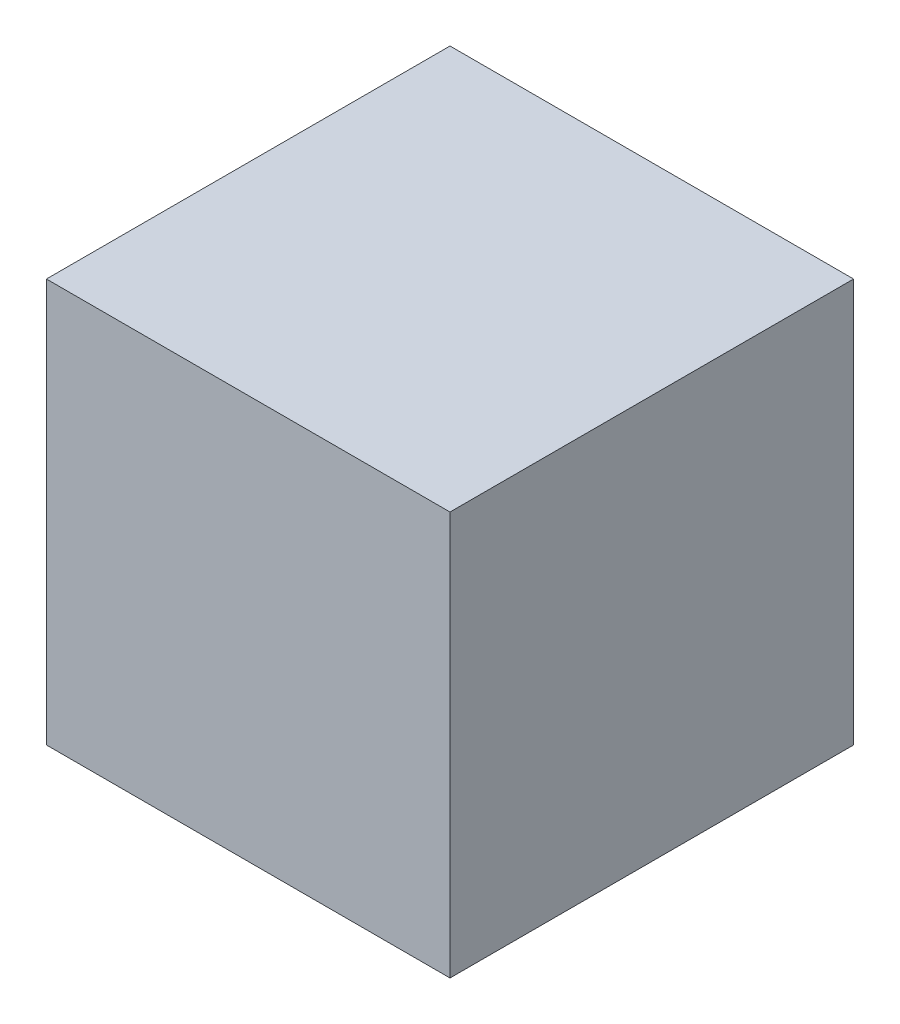
ISO-10303-21;
HEADER;
FILE_DESCRIPTION(('STEP AP214'),'2;1');
FILE_NAME('part.step','',(''),(''),'','','');
FILE_SCHEMA(('AUTOMOTIVE_DESIGN { 1 0 10303 214 1 1 1 1 }'));
ENDSEC;
DATA;
#1=APPLICATION_CONTEXT('core data for automotive mechanical design processes');
#2=APPLICATION_PROTOCOL_DEFINITION('international standard','automotive_design',2000,#1);
#3=PRODUCT_CONTEXT('',#1,'mechanical');
#4=PRODUCT('Part','Part','',(#3));
#5=PRODUCT_RELATED_PRODUCT_CATEGORY('part','',(#4));
#6=PRODUCT_DEFINITION_FORMATION('','',#4);
#7=PRODUCT_DEFINITION_CONTEXT('part definition',#1,'design');
#8=PRODUCT_DEFINITION('design','',#6,#7);
#9=PRODUCT_DEFINITION_SHAPE('','',#8);
#10=(LENGTH_UNIT() NAMED_UNIT(*) SI_UNIT(.MILLI.,.METRE.));
#11=(NAMED_UNIT(*) PLANE_ANGLE_UNIT() SI_UNIT($,.RADIAN.));
#12=(NAMED_UNIT(*) SI_UNIT($,.STERADIAN.) SOLID_ANGLE_UNIT());
#13=UNCERTAINTY_MEASURE_WITH_UNIT(LENGTH_MEASURE(1.E-05),#10,'distance_accuracy_value','');
#14=(GEOMETRIC_REPRESENTATION_CONTEXT(3) GLOBAL_UNCERTAINTY_ASSIGNED_CONTEXT((#13)) GLOBAL_UNIT_ASSIGNED_CONTEXT((#10,
#11,#12)) REPRESENTATION_CONTEXT('',''));
#15=CARTESIAN_POINT('',(0.,0.,0.));
#16=DIRECTION('',(0.,0.,1.));
#17=DIRECTION('',(1.,0.,0.));
#18=AXIS2_PLACEMENT_3D('',#15,#16,#17);
#19=CARTESIAN_POINT('',(0.,990.,0.));
#20=DIRECTION('',(1.,0.,0.));
#21=DIRECTION('',(0.,0.,-1.));
#22=AXIS2_PLACEMENT_3D('',#19,#20,#21);
#23=PLANE('',#22);
#24=DIRECTION('',(0.,0.,1.));
#25=VECTOR('',#24,1.);
#26=CARTESIAN_POINT('',(0.,0.,0.));
#27=LINE('',#26,#25);
#28=CARTESIAN_POINT('',(0.,0.,-1000.));
#29=VERTEX_POINT('',#28);
#30=CARTESIAN_POINT('',(0.,0.,0.));
#31=VERTEX_POINT('',#30);
#32=EDGE_CURVE('E108',#29,#31,#27,.T.);
#33=ORIENTED_EDGE('',*,*,#32,.T.);
#34=DIRECTION('',(0.,-1.,0.));
#35=VECTOR('',#34,1.);
#36=CARTESIAN_POINT('',(0.,990.,0.));
#37=LINE('',#36,#35);
#38=CARTESIAN_POINT('',(0.,1000.,0.));
#39=VERTEX_POINT('',#38);
#40=EDGE_CURVE('E11',#39,#31,#37,.T.);
#41=ORIENTED_EDGE('',*,*,#40,.F.);
#42=DIRECTION('',(0.,0.,1.));
#43=VECTOR('',#42,1.);
#44=CARTESIAN_POINT('',(0.,1000.,-1000.));
#45=LINE('',#44,#43);
#46=CARTESIAN_POINT('',(0.,1000.,-1000.));
#47=VERTEX_POINT('',#46);
#48=EDGE_CURVE('E106',#47,#39,#45,.T.);
#49=ORIENTED_EDGE('',*,*,#48,.F.);
#50=DIRECTION('',(0.,-1.,0.));
#51=VECTOR('',#50,1.);
#52=CARTESIAN_POINT('',(0.,990.,-1000.));
#53=LINE('',#52,#51);
#54=EDGE_CURVE('E164',#47,#29,#53,.T.);
#55=ORIENTED_EDGE('',*,*,#54,.T.);
#56=EDGE_LOOP('',(#33,#41,#49,#55));
#57=FACE_BOUND('',#56,.T.);
#58=ADVANCED_FACE('F38',(#57),#23,.F.);
#59=CARTESIAN_POINT('',(0.,990.,0.));
#60=DIRECTION('',(0.,0.,-1.));
#61=DIRECTION('',(-1.,0.,0.));
#62=AXIS2_PLACEMENT_3D('',#59,#60,#61);
#63=PLANE('',#62);
#64=DIRECTION('',(1.,0.,0.));
#65=VECTOR('',#64,1.);
#66=CARTESIAN_POINT('',(0.,0.,0.));
#67=LINE('',#66,#65);
#68=CARTESIAN_POINT('',(1000.,0.,0.));
#69=VERTEX_POINT('',#68);
#70=EDGE_CURVE('E160',#31,#69,#67,.T.);
#71=ORIENTED_EDGE('',*,*,#70,.T.);
#72=DIRECTION('',(0.,-1.,0.));
#73=VECTOR('',#72,1.);
#74=CARTESIAN_POINT('',(1000.,990.,0.));
#75=LINE('',#74,#73);
#76=CARTESIAN_POINT('',(1000.,1000.,0.));
#77=VERTEX_POINT('',#76);
#78=EDGE_CURVE('E46',#77,#69,#75,.T.);
#79=ORIENTED_EDGE('',*,*,#78,.F.);
#80=DIRECTION('',(1.,0.,0.));
#81=VECTOR('',#80,1.);
#82=CARTESIAN_POINT('',(0.,1000.,0.));
#83=LINE('',#82,#81);
#84=EDGE_CURVE('E111',#39,#77,#83,.T.);
#85=ORIENTED_EDGE('',*,*,#84,.F.);
#86=ORIENTED_EDGE('',*,*,#40,.T.);
#87=EDGE_LOOP('',(#71,#79,#85,#86));
#88=FACE_BOUND('',#87,.T.);
#89=ADVANCED_FACE('F112',(#88),#63,.F.);
#90=CARTESIAN_POINT('',(1000.,990.,0.));
#91=DIRECTION('',(-1.,0.,0.));
#92=DIRECTION('',(0.,0.,1.));
#93=AXIS2_PLACEMENT_3D('',#90,#91,#92);
#94=PLANE('',#93);
#95=DIRECTION('',(0.,0.,-1.));
#96=VECTOR('',#95,1.);
#97=CARTESIAN_POINT('',(1000.,0.,0.));
#98=LINE('',#97,#96);
#99=CARTESIAN_POINT('',(1000.,0.,-1000.));
#100=VERTEX_POINT('',#99);
#101=EDGE_CURVE('E61',#69,#100,#98,.T.);
#102=ORIENTED_EDGE('',*,*,#101,.T.);
#103=DIRECTION('',(0.,-1.,0.));
#104=VECTOR('',#103,1.);
#105=CARTESIAN_POINT('',(1000.,990.,-1000.));
#106=LINE('',#105,#104);
#107=CARTESIAN_POINT('',(1000.,1000.,-1000.));
#108=VERTEX_POINT('',#107);
#109=EDGE_CURVE('E166',#108,#100,#106,.T.);
#110=ORIENTED_EDGE('',*,*,#109,.F.);
#111=DIRECTION('',(0.,0.,-1.));
#112=VECTOR('',#111,1.);
#113=CARTESIAN_POINT('',(1000.,1000.,-1000.));
#114=LINE('',#113,#112);
#115=EDGE_CURVE('E116',#77,#108,#114,.T.);
#116=ORIENTED_EDGE('',*,*,#115,.F.);
#117=ORIENTED_EDGE('',*,*,#78,.T.);
#118=EDGE_LOOP('',(#102,#110,#116,#117));
#119=FACE_BOUND('',#118,.T.);
#120=ADVANCED_FACE('F167',(#119),#94,.F.);
#121=CARTESIAN_POINT('',(0.,990.,-1000.));
#122=DIRECTION('',(0.,0.,1.));
#123=DIRECTION('',(1.,0.,0.));
#124=AXIS2_PLACEMENT_3D('',#121,#122,#123);
#125=PLANE('',#124);
#126=DIRECTION('',(-1.,0.,0.));
#127=VECTOR('',#126,1.);
#128=CARTESIAN_POINT('',(0.,0.,-1000.));
#129=LINE('',#128,#127);
#130=EDGE_CURVE('E53',#100,#29,#129,.T.);
#131=ORIENTED_EDGE('',*,*,#130,.T.);
#132=ORIENTED_EDGE('',*,*,#54,.F.);
#133=DIRECTION('',(-1.,0.,0.));
#134=VECTOR('',#133,1.);
#135=CARTESIAN_POINT('',(0.,1000.,-1000.));
#136=LINE('',#135,#134);
#137=EDGE_CURVE('E121',#108,#47,#136,.T.);
#138=ORIENTED_EDGE('',*,*,#137,.F.);
#139=ORIENTED_EDGE('',*,*,#109,.T.);
#140=EDGE_LOOP('',(#131,#132,#138,#139));
#141=FACE_BOUND('',#140,.T.);
#142=ADVANCED_FACE('F171',(#141),#125,.F.);
#143=CARTESIAN_POINT('',(0.,0.,0.));
#144=DIRECTION('',(0.,-1.,0.));
#145=DIRECTION('',(0.,0.,-1.));
#146=AXIS2_PLACEMENT_3D('',#143,#144,#145);
#147=PLANE('',#146);
#148=ORIENTED_EDGE('',*,*,#32,.F.);
#149=ORIENTED_EDGE('',*,*,#130,.F.);
#150=ORIENTED_EDGE('',*,*,#101,.F.);
#151=ORIENTED_EDGE('',*,*,#70,.F.);
#152=EDGE_LOOP('',(#148,#149,#150,#151));
#153=FACE_BOUND('',#152,.T.);
#154=ADVANCED_FACE('F169',(#153),#147,.T.);
#155=CARTESIAN_POINT('',(0.,1000.,0.));
#156=DIRECTION('',(0.,1.,0.));
#157=DIRECTION('',(0.,0.,1.));
#158=AXIS2_PLACEMENT_3D('',#155,#156,#157);
#159=PLANE('',#158);
#160=ORIENTED_EDGE('',*,*,#48,.T.);
#161=ORIENTED_EDGE('',*,*,#84,.T.);
#162=ORIENTED_EDGE('',*,*,#115,.T.);
#163=ORIENTED_EDGE('',*,*,#137,.T.);
#164=EDGE_LOOP('',(#160,#161,#162,#163));
#165=FACE_BOUND('',#164,.T.);
#166=ADVANCED_FACE('F119',(#165),#159,.T.);
#167=CLOSED_SHELL('',(#58,#89,#120,#142,#154,#166));
#168=CARTESIAN_POINT('',(0.,10.,0.));
#169=DIRECTION('',(0.,-1.,0.));
#170=DIRECTION('',(0.,0.,-1.));
#171=AXIS2_PLACEMENT_3D('',#168,#169,#170);
#172=PLANE('',#171);
#173=DIRECTION('',(0.,0.,1.));
#174=VECTOR('',#173,1.);
#175=CARTESIAN_POINT('',(10.,10.,0.));
#176=LINE('',#175,#174);
#177=CARTESIAN_POINT('',(10.,10.,-990.));
#178=VERTEX_POINT('',#177);
#179=CARTESIAN_POINT('',(10.,10.,-10.));
#180=VERTEX_POINT('',#179);
#181=EDGE_CURVE('E126',#178,#180,#176,.T.);
#182=ORIENTED_EDGE('',*,*,#181,.T.);
#183=DIRECTION('',(1.,0.,0.));
#184=VECTOR('',#183,1.);
#185=CARTESIAN_POINT('',(0.,10.,-10.));
#186=LINE('',#185,#184);
#187=CARTESIAN_POINT('',(990.,10.,-10.));
#188=VERTEX_POINT('',#187);
#189=EDGE_CURVE('E129',#180,#188,#186,.T.);
#190=ORIENTED_EDGE('',*,*,#189,.T.);
#191=DIRECTION('',(0.,0.,-1.));
#192=VECTOR('',#191,1.);
#193=CARTESIAN_POINT('',(990.,10.,0.));
#194=LINE('',#193,#192);
#195=CARTESIAN_POINT('',(990.,10.,-990.));
#196=VERTEX_POINT('',#195);
#197=EDGE_CURVE('E140',#188,#196,#194,.T.);
#198=ORIENTED_EDGE('',*,*,#197,.T.);
#199=DIRECTION('',(-1.,0.,0.));
#200=VECTOR('',#199,1.);
#201=CARTESIAN_POINT('',(0.,10.,-990.));
#202=LINE('',#201,#200);
#203=EDGE_CURVE('E144',#196,#178,#202,.T.);
#204=ORIENTED_EDGE('',*,*,#203,.T.);
#205=EDGE_LOOP('',(#182,#190,#198,#204));
#206=FACE_BOUND('',#205,.T.);
#207=ADVANCED_FACE('F215',(#206),#172,.F.);
#208=CARTESIAN_POINT('',(0.,990.,-10.));
#209=DIRECTION('',(0.,0.,-1.));
#210=DIRECTION('',(-1.,0.,0.));
#211=AXIS2_PLACEMENT_3D('',#208,#209,#210);
#212=PLANE('',#211);
#213=ORIENTED_EDGE('',*,*,#189,.F.);
#214=DIRECTION('',(0.,-1.,0.));
#215=VECTOR('',#214,1.);
#216=CARTESIAN_POINT('',(10.,990.,-10.));
#217=LINE('',#216,#215);
#218=CARTESIAN_POINT('',(10.,990.,-10.));
#219=VERTEX_POINT('',#218);
#220=EDGE_CURVE('E130',#219,#180,#217,.T.);
#221=ORIENTED_EDGE('',*,*,#220,.F.);
#222=DIRECTION('',(1.,0.,0.));
#223=VECTOR('',#222,1.);
#224=CARTESIAN_POINT('',(0.,990.,-10.));
#225=LINE('',#224,#223);
#226=CARTESIAN_POINT('',(990.,990.,-10.));
#227=VERTEX_POINT('',#226);
#228=EDGE_CURVE('E151',#219,#227,#225,.T.);
#229=ORIENTED_EDGE('',*,*,#228,.T.);
#230=DIRECTION('',(0.,-1.,0.));
#231=VECTOR('',#230,1.);
#232=CARTESIAN_POINT('',(990.,990.,-10.));
#233=LINE('',#232,#231);
#234=EDGE_CURVE('E133',#227,#188,#233,.T.);
#235=ORIENTED_EDGE('',*,*,#234,.T.);
#236=EDGE_LOOP('',(#213,#221,#229,#235));
#237=FACE_BOUND('',#236,.T.);
#238=ADVANCED_FACE('F209',(#237),#212,.T.);
#239=CARTESIAN_POINT('',(990.,990.,0.));
#240=DIRECTION('',(-1.,0.,0.));
#241=DIRECTION('',(0.,0.,1.));
#242=AXIS2_PLACEMENT_3D('',#239,#240,#241);
#243=PLANE('',#242);
#244=ORIENTED_EDGE('',*,*,#197,.F.);
#245=ORIENTED_EDGE('',*,*,#234,.F.);
#246=DIRECTION('',(0.,0.,-1.));
#247=VECTOR('',#246,1.);
#248=CARTESIAN_POINT('',(990.,990.,0.));
#249=LINE('',#248,#247);
#250=CARTESIAN_POINT('',(990.,990.,-990.));
#251=VERTEX_POINT('',#250);
#252=EDGE_CURVE('E154',#227,#251,#249,.T.);
#253=ORIENTED_EDGE('',*,*,#252,.T.);
#254=DIRECTION('',(0.,-1.,0.));
#255=VECTOR('',#254,1.);
#256=CARTESIAN_POINT('',(990.,990.,-990.));
#257=LINE('',#256,#255);
#258=EDGE_CURVE('E137',#251,#196,#257,.T.);
#259=ORIENTED_EDGE('',*,*,#258,.T.);
#260=EDGE_LOOP('',(#244,#245,#253,#259));
#261=FACE_BOUND('',#260,.T.);
#262=ADVANCED_FACE('F214',(#261),#243,.T.);
#263=CARTESIAN_POINT('',(0.,990.,-990.));
#264=DIRECTION('',(0.,0.,1.));
#265=DIRECTION('',(1.,0.,0.));
#266=AXIS2_PLACEMENT_3D('',#263,#264,#265);
#267=PLANE('',#266);
#268=ORIENTED_EDGE('',*,*,#203,.F.);
#269=ORIENTED_EDGE('',*,*,#258,.F.);
#270=DIRECTION('',(-1.,0.,0.));
#271=VECTOR('',#270,1.);
#272=CARTESIAN_POINT('',(0.,990.,-990.));
#273=LINE('',#272,#271);
#274=CARTESIAN_POINT('',(10.,990.,-990.));
#275=VERTEX_POINT('',#274);
#276=EDGE_CURVE('E138',#251,#275,#273,.T.);
#277=ORIENTED_EDGE('',*,*,#276,.T.);
#278=DIRECTION('',(0.,-1.,0.));
#279=VECTOR('',#278,1.);
#280=CARTESIAN_POINT('',(10.,990.,-990.));
#281=LINE('',#280,#279);
#282=EDGE_CURVE('E134',#275,#178,#281,.T.);
#283=ORIENTED_EDGE('',*,*,#282,.T.);
#284=EDGE_LOOP('',(#268,#269,#277,#283));
#285=FACE_BOUND('',#284,.T.);
#286=ADVANCED_FACE('F228',(#285),#267,.T.);
#287=CARTESIAN_POINT('',(10.,990.,0.));
#288=DIRECTION('',(1.,0.,0.));
#289=DIRECTION('',(0.,0.,-1.));
#290=AXIS2_PLACEMENT_3D('',#287,#288,#289);
#291=PLANE('',#290);
#292=ORIENTED_EDGE('',*,*,#181,.F.);
#293=ORIENTED_EDGE('',*,*,#282,.F.);
#294=DIRECTION('',(0.,0.,1.));
#295=VECTOR('',#294,1.);
#296=CARTESIAN_POINT('',(10.,990.,0.));
#297=LINE('',#296,#295);
#298=EDGE_CURVE('E148',#275,#219,#297,.T.);
#299=ORIENTED_EDGE('',*,*,#298,.T.);
#300=ORIENTED_EDGE('',*,*,#220,.T.);
#301=EDGE_LOOP('',(#292,#293,#299,#300));
#302=FACE_BOUND('',#301,.T.);
#303=ADVANCED_FACE('F239',(#302),#291,.T.);
#304=CARTESIAN_POINT('',(0.,990.,0.));
#305=DIRECTION('',(0.,1.,0.));
#306=DIRECTION('',(0.,0.,1.));
#307=AXIS2_PLACEMENT_3D('',#304,#305,#306);
#308=PLANE('',#307);
#309=ORIENTED_EDGE('',*,*,#298,.F.);
#310=ORIENTED_EDGE('',*,*,#276,.F.);
#311=ORIENTED_EDGE('',*,*,#252,.F.);
#312=ORIENTED_EDGE('',*,*,#228,.F.);
#313=EDGE_LOOP('',(#309,#310,#311,#312));
#314=FACE_BOUND('',#313,.T.);
#315=ADVANCED_FACE('F250',(#314),#308,.F.);
#316=CLOSED_SHELL('',(#207,#238,#262,#286,#303,#315));
#317=ORIENTED_CLOSED_SHELL('',*,#316,.T.);
#318=BREP_WITH_VOIDS('B2',#167,(#317));
#319=ADVANCED_BREP_SHAPE_REPRESENTATION('',(#18,#318),#14);
#320=SHAPE_DEFINITION_REPRESENTATION(#9,#319);
ENDSEC;
END-ISO-10303-21;
